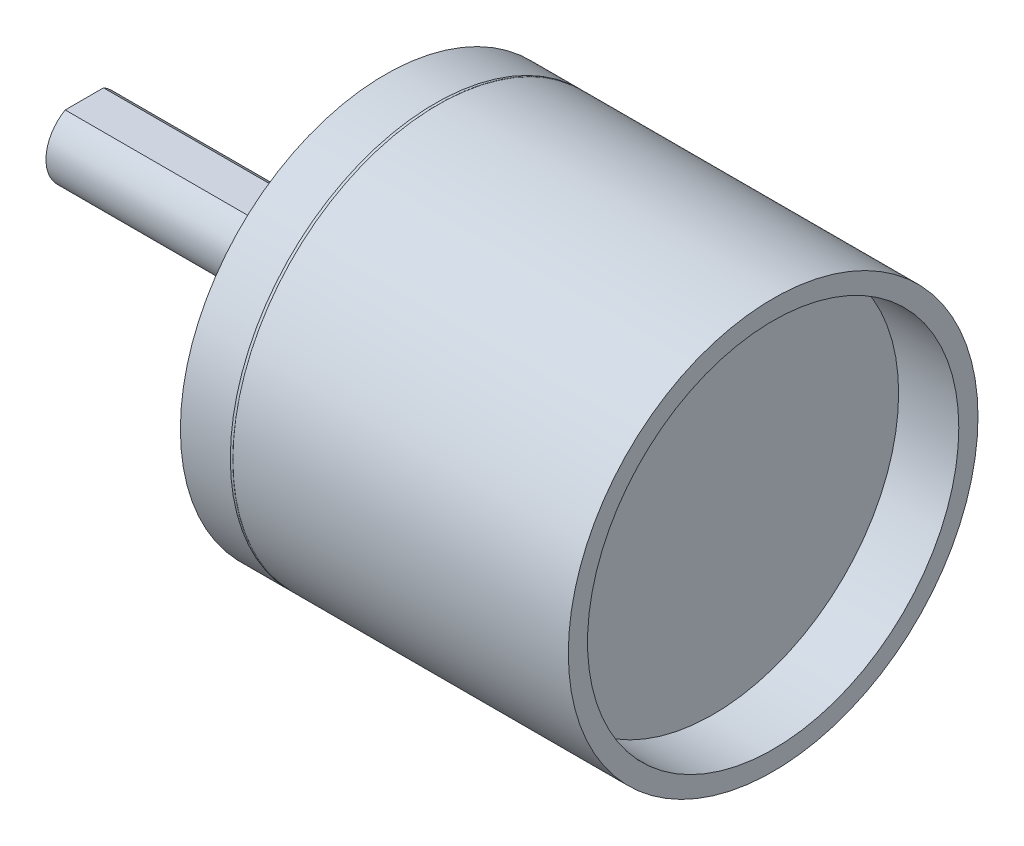
ISO-10303-21;
HEADER;
FILE_DESCRIPTION(('STEP AP214'),'2;1');
FILE_NAME('part.step','',(''),(''),'','','');
FILE_SCHEMA(('AUTOMOTIVE_DESIGN { 1 0 10303 214 1 1 1 1 }'));
ENDSEC;
DATA;
#1=APPLICATION_CONTEXT('core data for automotive mechanical design processes');
#2=APPLICATION_PROTOCOL_DEFINITION('international standard','automotive_design',2000,#1);
#3=PRODUCT_CONTEXT('',#1,'mechanical');
#4=PRODUCT('Part','Part','',(#3));
#5=PRODUCT_RELATED_PRODUCT_CATEGORY('part','',(#4));
#6=PRODUCT_DEFINITION_FORMATION('','',#4);
#7=PRODUCT_DEFINITION_CONTEXT('part definition',#1,'design');
#8=PRODUCT_DEFINITION('design','',#6,#7);
#9=PRODUCT_DEFINITION_SHAPE('','',#8);
#10=(LENGTH_UNIT() NAMED_UNIT(*) SI_UNIT(.MILLI.,.METRE.));
#11=(NAMED_UNIT(*) PLANE_ANGLE_UNIT() SI_UNIT($,.RADIAN.));
#12=(NAMED_UNIT(*) SI_UNIT($,.STERADIAN.) SOLID_ANGLE_UNIT());
#13=UNCERTAINTY_MEASURE_WITH_UNIT(LENGTH_MEASURE(1.E-05),#10,'distance_accuracy_value','');
#14=(GEOMETRIC_REPRESENTATION_CONTEXT(3) GLOBAL_UNCERTAINTY_ASSIGNED_CONTEXT((#13)) GLOBAL_UNIT_ASSIGNED_CONTEXT((#10,
#11,#12)) REPRESENTATION_CONTEXT('',''));
#15=CARTESIAN_POINT('',(0.,0.,0.));
#16=DIRECTION('',(0.,0.,1.));
#17=DIRECTION('',(1.,0.,0.));
#18=AXIS2_PLACEMENT_3D('',#15,#16,#17);
#19=CARTESIAN_POINT('',(-2.6,0.,0.));
#20=DIRECTION('',(-1.,0.,0.));
#21=DIRECTION('',(0.,0.,1.));
#22=AXIS2_PLACEMENT_3D('',#19,#20,#21);
#23=PLANE('',#22);
#24=CARTESIAN_POINT('',(-2.6,0.,0.));
#25=DIRECTION('',(-1.,0.,0.));
#26=DIRECTION('',(0.,0.,1.));
#27=AXIS2_PLACEMENT_3D('',#24,#25,#26);
#28=CIRCLE('',#27,2.5);
#29=CARTESIAN_POINT('',(-2.6,0.,2.5));
#30=VERTEX_POINT('',#29);
#31=EDGE_CURVE('E145',#30,#30,#28,.T.);
#32=ORIENTED_EDGE('',*,*,#31,.T.);
#33=EDGE_LOOP('',(#32));
#34=FACE_BOUND('',#33,.T.);
#35=CARTESIAN_POINT('',(-2.6,0.,0.));
#36=DIRECTION('',(-1.,0.,0.));
#37=DIRECTION('',(0.,0.,1.));
#38=AXIS2_PLACEMENT_3D('',#35,#36,#37);
#39=CIRCLE('',#38,1.5);
#40=CARTESIAN_POINT('',(-2.6,0.,1.5));
#41=VERTEX_POINT('',#40);
#42=EDGE_CURVE('E137',#41,#41,#39,.T.);
#43=ORIENTED_EDGE('',*,*,#42,.F.);
#44=EDGE_LOOP('',(#43));
#45=FACE_BOUND('',#44,.T.);
#46=ADVANCED_FACE('F34',(#34,#45),#23,.T.);
#47=CARTESIAN_POINT('',(-1.,0.,0.));
#48=DIRECTION('',(-1.,0.,0.));
#49=DIRECTION('',(0.,0.,1.));
#50=AXIS2_PLACEMENT_3D('',#47,#48,#49);
#51=PLANE('',#50);
#52=CARTESIAN_POINT('',(-1.,0.,0.));
#53=DIRECTION('',(-1.,0.,0.));
#54=DIRECTION('',(0.,0.,1.));
#55=AXIS2_PLACEMENT_3D('',#52,#53,#54);
#56=CIRCLE('',#55,3.);
#57=CARTESIAN_POINT('',(-1.,0.,3.));
#58=VERTEX_POINT('',#57);
#59=EDGE_CURVE('E151',#58,#58,#56,.T.);
#60=ORIENTED_EDGE('',*,*,#59,.T.);
#61=EDGE_LOOP('',(#60));
#62=FACE_BOUND('',#61,.T.);
#63=CARTESIAN_POINT('',(-1.,0.,0.));
#64=DIRECTION('',(-1.,0.,0.));
#65=DIRECTION('',(0.,0.,1.));
#66=AXIS2_PLACEMENT_3D('',#63,#64,#65);
#67=CIRCLE('',#66,2.5);
#68=CARTESIAN_POINT('',(-1.,0.,2.5));
#69=VERTEX_POINT('',#68);
#70=EDGE_CURVE('E142',#69,#69,#67,.T.);
#71=ORIENTED_EDGE('',*,*,#70,.F.);
#72=EDGE_LOOP('',(#71));
#73=FACE_BOUND('',#72,.T.);
#74=ADVANCED_FACE('F182',(#62,#73),#51,.T.);
#75=CARTESIAN_POINT('',(0.,7.99999999999967,0.));
#76=DIRECTION('',(-1.,0.,0.));
#77=DIRECTION('',(0.,0.,1.));
#78=AXIS2_PLACEMENT_3D('',#75,#76,#77);
#79=PLANE('',#78);
#80=CARTESIAN_POINT('',(0.,4.999999999992,8.726646259967E-06));
#81=DIRECTION('',(-1.,0.,0.));
#82=DIRECTION('',(0.,0.,1.));
#83=AXIS2_PLACEMENT_3D('',#80,#81,#82);
#84=CIRCLE('',#83,0.79999999999999);
#85=CARTESIAN_POINT('',(0.,4.999999999992,0.80000872664625));
#86=VERTEX_POINT('',#85);
#87=EDGE_CURVE('E93',#86,#86,#84,.T.);
#88=ORIENTED_EDGE('',*,*,#87,.F.);
#89=EDGE_LOOP('',(#88));
#90=FACE_BOUND('',#89,.T.);
#91=CARTESIAN_POINT('',(0.,2.499992442499,4.330131382239));
#92=DIRECTION('',(-1.,0.,0.));
#93=DIRECTION('',(0.,0.,1.));
#94=AXIS2_PLACEMENT_3D('',#91,#92,#93);
#95=CIRCLE('',#94,0.79999999999999);
#96=CARTESIAN_POINT('',(0.,2.499992442499,5.13013138223899));
#97=VERTEX_POINT('',#96);
#98=EDGE_CURVE('E92',#97,#97,#95,.T.);
#99=ORIENTED_EDGE('',*,*,#98,.F.);
#100=EDGE_LOOP('',(#99));
#101=FACE_BOUND('',#100,.T.);
#102=CARTESIAN_POINT('',(0.,-2.500007557494,4.330122655592));
#103=DIRECTION('',(-1.,0.,0.));
#104=DIRECTION('',(0.,0.,1.));
#105=AXIS2_PLACEMENT_3D('',#102,#103,#104);
#106=CIRCLE('',#105,0.79999999999999);
#107=CARTESIAN_POINT('',(0.,-2.500007557494,5.13012265559199));
#108=VERTEX_POINT('',#107);
#109=EDGE_CURVE('E103',#108,#108,#106,.T.);
#110=ORIENTED_EDGE('',*,*,#109,.F.);
#111=EDGE_LOOP('',(#110));
#112=FACE_BOUND('',#111,.T.);
#113=CARTESIAN_POINT('',(0.,-4.999999999992,-8.726646259355E-06));
#114=DIRECTION('',(-1.,0.,0.));
#115=DIRECTION('',(0.,0.,1.));
#116=AXIS2_PLACEMENT_3D('',#113,#114,#115);
#117=CIRCLE('',#116,0.79999999999999);
#118=CARTESIAN_POINT('',(0.,-4.999999999992,0.799991273353731));
#119=VERTEX_POINT('',#118);
#120=EDGE_CURVE('E109',#119,#119,#117,.T.);
#121=ORIENTED_EDGE('',*,*,#120,.F.);
#122=EDGE_LOOP('',(#121));
#123=FACE_BOUND('',#122,.T.);
#124=CARTESIAN_POINT('',(0.,-2.499992442499,-4.330131382239));
#125=DIRECTION('',(-1.,0.,0.));
#126=DIRECTION('',(0.,0.,1.));
#127=AXIS2_PLACEMENT_3D('',#124,#125,#126);
#128=CIRCLE('',#127,0.79999999999999);
#129=CARTESIAN_POINT('',(0.,-2.499992442499,-3.53013138223901));
#130=VERTEX_POINT('',#129);
#131=EDGE_CURVE('E115',#130,#130,#128,.T.);
#132=ORIENTED_EDGE('',*,*,#131,.F.);
#133=EDGE_LOOP('',(#132));
#134=FACE_BOUND('',#133,.T.);
#135=CARTESIAN_POINT('',(0.,2.500007557494,-4.330122655592));
#136=DIRECTION('',(-1.,0.,0.));
#137=DIRECTION('',(0.,0.,1.));
#138=AXIS2_PLACEMENT_3D('',#135,#136,#137);
#139=CIRCLE('',#138,0.79999999999999);
#140=CARTESIAN_POINT('',(0.,2.500007557494,-3.53012265559201));
#141=VERTEX_POINT('',#140);
#142=EDGE_CURVE('E121',#141,#141,#139,.T.);
#143=ORIENTED_EDGE('',*,*,#142,.F.);
#144=EDGE_LOOP('',(#143));
#145=FACE_BOUND('',#144,.T.);
#146=CARTESIAN_POINT('',(0.,-3.33305713513381E-13,0.));
#147=DIRECTION('',(1.,0.,0.));
#148=DIRECTION('',(0.,0.,-1.));
#149=AXIS2_PLACEMENT_3D('',#146,#147,#148);
#150=CIRCLE('',#149,8.);
#151=CARTESIAN_POINT('',(0.,-3.33305713513381E-13,-8.));
#152=VERTEX_POINT('',#151);
#153=EDGE_CURVE('E154',#152,#152,#150,.T.);
#154=ORIENTED_EDGE('',*,*,#153,.F.);
#155=EDGE_LOOP('',(#154));
#156=FACE_BOUND('',#155,.T.);
#157=CARTESIAN_POINT('',(0.,0.,0.));
#158=DIRECTION('',(-1.,0.,0.));
#159=DIRECTION('',(0.,0.,1.));
#160=AXIS2_PLACEMENT_3D('',#157,#158,#159);
#161=CIRCLE('',#160,3.);
#162=CARTESIAN_POINT('',(0.,0.,3.));
#163=VERTEX_POINT('',#162);
#164=EDGE_CURVE('E148',#163,#163,#161,.T.);
#165=ORIENTED_EDGE('',*,*,#164,.F.);
#166=EDGE_LOOP('',(#165));
#167=FACE_BOUND('',#166,.T.);
#168=ADVANCED_FACE('F179',(#90,#101,#112,#123,#134,#145,#156,#167),#79,.T.);
#169=CARTESIAN_POINT('',(0.,-3.33305713513381E-13,0.));
#170=DIRECTION('',(1.,0.,0.));
#171=DIRECTION('',(0.,0.,-1.));
#172=AXIS2_PLACEMENT_3D('',#169,#170,#171);
#173=CYLINDRICAL_SURFACE('',#172,8.);
#174=ORIENTED_EDGE('',*,*,#153,.T.);
#175=EDGE_LOOP('',(#174));
#176=FACE_BOUND('',#175,.T.);
#177=CARTESIAN_POINT('',(1.94999999999981,-3.33305713513381E-13,0.));
#178=DIRECTION('',(1.,0.,0.));
#179=DIRECTION('',(0.,0.,-1.));
#180=AXIS2_PLACEMENT_3D('',#177,#178,#179);
#181=CIRCLE('',#180,8.);
#182=CARTESIAN_POINT('',(1.94999999999981,-3.33305713513381E-13,-8.));
#183=VERTEX_POINT('',#182);
#184=EDGE_CURVE('E11',#183,#183,#181,.T.);
#185=ORIENTED_EDGE('',*,*,#184,.F.);
#186=EDGE_LOOP('',(#185));
#187=FACE_BOUND('',#186,.T.);
#188=ADVANCED_FACE('F170',(#176,#187),#173,.T.);
#189=CARTESIAN_POINT('',(1.9999999999999,-3.33066907387547E-13,0.));
#190=DIRECTION('',(1.,0.,0.));
#191=DIRECTION('',(0.,0.,-1.));
#192=AXIS2_PLACEMENT_3D('',#189,#190,#191);
#193=TOROIDAL_SURFACE('',#192,8.08660254037817,0.0999999999998071);
#194=ORIENTED_EDGE('',*,*,#184,.T.);
#195=EDGE_LOOP('',(#194));
#196=FACE_BOUND('',#195,.T.);
#197=CARTESIAN_POINT('',(2.05,-3.33305713513381E-13,0.));
#198=DIRECTION('',(1.,0.,0.));
#199=DIRECTION('',(0.,0.,-1.));
#200=AXIS2_PLACEMENT_3D('',#197,#198,#199);
#201=CIRCLE('',#200,8.);
#202=CARTESIAN_POINT('',(2.05,-3.33305713513381E-13,-8.));
#203=VERTEX_POINT('',#202);
#204=EDGE_CURVE('E43',#203,#203,#201,.T.);
#205=ORIENTED_EDGE('',*,*,#204,.F.);
#206=EDGE_LOOP('',(#205));
#207=FACE_BOUND('',#206,.T.);
#208=ADVANCED_FACE('F168',(#196,#207),#193,.F.);
#209=CARTESIAN_POINT('',(0.,-3.33305713513381E-13,0.));
#210=DIRECTION('',(1.,0.,0.));
#211=DIRECTION('',(0.,0.,-1.));
#212=AXIS2_PLACEMENT_3D('',#209,#210,#211);
#213=CYLINDRICAL_SURFACE('',#212,8.);
#214=ORIENTED_EDGE('',*,*,#204,.T.);
#215=EDGE_LOOP('',(#214));
#216=FACE_BOUND('',#215,.T.);
#217=CARTESIAN_POINT('',(15.15,-3.33305713513381E-13,0.));
#218=DIRECTION('',(1.,0.,0.));
#219=DIRECTION('',(0.,0.,-1.));
#220=AXIS2_PLACEMENT_3D('',#217,#218,#219);
#221=CIRCLE('',#220,8.);
#222=CARTESIAN_POINT('',(15.15,-3.33305713513381E-13,-8.));
#223=VERTEX_POINT('',#222);
#224=EDGE_CURVE('E159',#223,#223,#221,.T.);
#225=ORIENTED_EDGE('',*,*,#224,.F.);
#226=EDGE_LOOP('',(#225));
#227=FACE_BOUND('',#226,.T.);
#228=ADVANCED_FACE('F165',(#216,#227),#213,.T.);
#229=CARTESIAN_POINT('',(15.15,-3.33305713513381E-13,0.));
#230=DIRECTION('',(1.,0.,0.));
#231=DIRECTION('',(0.,0.,-1.));
#232=AXIS2_PLACEMENT_3D('',#229,#230,#231);
#233=PLANE('',#232);
#234=CARTESIAN_POINT('',(15.15,0.,0.));
#235=DIRECTION('',(1.,0.,0.));
#236=DIRECTION('',(0.,0.,-1.));
#237=AXIS2_PLACEMENT_3D('',#234,#235,#236);
#238=CIRCLE('',#237,7.24999999999999);
#239=CARTESIAN_POINT('',(15.15,0.,-7.24999999999999));
#240=VERTEX_POINT('',#239);
#241=EDGE_CURVE('E127',#240,#240,#238,.T.);
#242=ORIENTED_EDGE('',*,*,#241,.F.);
#243=EDGE_LOOP('',(#242));
#244=FACE_BOUND('',#243,.T.);
#245=ORIENTED_EDGE('',*,*,#224,.T.);
#246=EDGE_LOOP('',(#245));
#247=FACE_BOUND('',#246,.T.);
#248=ADVANCED_FACE('F177',(#244,#247),#233,.T.);
#249=CARTESIAN_POINT('',(-1.,0.,0.));
#250=DIRECTION('',(1.,0.,0.));
#251=DIRECTION('',(0.,0.,-1.));
#252=AXIS2_PLACEMENT_3D('',#249,#250,#251);
#253=CYLINDRICAL_SURFACE('',#252,3.);
#254=ORIENTED_EDGE('',*,*,#59,.F.);
#255=EDGE_LOOP('',(#254));
#256=FACE_BOUND('',#255,.T.);
#257=ORIENTED_EDGE('',*,*,#164,.T.);
#258=EDGE_LOOP('',(#257));
#259=FACE_BOUND('',#258,.T.);
#260=ADVANCED_FACE('F197',(#256,#259),#253,.T.);
#261=CARTESIAN_POINT('',(-2.6,0.,0.));
#262=DIRECTION('',(1.,0.,0.));
#263=DIRECTION('',(0.,0.,-1.));
#264=AXIS2_PLACEMENT_3D('',#261,#262,#263);
#265=CYLINDRICAL_SURFACE('',#264,2.5);
#266=ORIENTED_EDGE('',*,*,#31,.F.);
#267=EDGE_LOOP('',(#266));
#268=FACE_BOUND('',#267,.T.);
#269=ORIENTED_EDGE('',*,*,#70,.T.);
#270=EDGE_LOOP('',(#269));
#271=FACE_BOUND('',#270,.T.);
#272=ADVANCED_FACE('F195',(#268,#271),#265,.T.);
#273=CARTESIAN_POINT('',(-11.75,0.,0.));
#274=DIRECTION('',(1.,0.,0.));
#275=DIRECTION('',(0.,0.,-1.));
#276=AXIS2_PLACEMENT_3D('',#273,#274,#275);
#277=CYLINDRICAL_SURFACE('',#276,1.5);
#278=CARTESIAN_POINT('',(-11.75,0.,0.));
#279=DIRECTION('',(-1.,0.,0.));
#280=DIRECTION('',(0.,0.,1.));
#281=AXIS2_PLACEMENT_3D('',#278,#279,#280);
#282=CIRCLE('',#281,1.5);
#283=CARTESIAN_POINT('',(-11.75,1.3,-0.748331477354792));
#284=VERTEX_POINT('',#283);
#285=CARTESIAN_POINT('',(-11.75,1.3,0.748331477354792));
#286=VERTEX_POINT('',#285);
#287=EDGE_CURVE('E139',#284,#286,#282,.T.);
#288=ORIENTED_EDGE('',*,*,#287,.F.);
#289=DIRECTION('',(-1.,0.,0.));
#290=VECTOR('',#289,1.);
#291=CARTESIAN_POINT('',(-3.95,1.3,-0.748331477354792));
#292=LINE('',#291,#290);
#293=CARTESIAN_POINT('',(-3.95,1.3,-0.748331477354792));
#294=VERTEX_POINT('',#293);
#295=EDGE_CURVE('E50',#294,#284,#292,.T.);
#296=ORIENTED_EDGE('',*,*,#295,.F.);
#297=CARTESIAN_POINT('',(-5.22750644205028,0.,0.));
#298=DIRECTION('',(-0.713250449154214,0.700909264299818,0.));
#299=DIRECTION('',(0.700909264299818,0.713250449154214,0.));
#300=AXIS2_PLACEMENT_3D('',#297,#298,#299);
#301=ELLIPSE('',#300,2.10304809731102,1.5);
#302=CARTESIAN_POINT('',(-3.95,1.3,0.748331477354792));
#303=VERTEX_POINT('',#302);
#304=EDGE_CURVE('E38',#303,#294,#301,.T.);
#305=ORIENTED_EDGE('',*,*,#304,.F.);
#306=DIRECTION('',(-1.,0.,0.));
#307=VECTOR('',#306,1.);
#308=CARTESIAN_POINT('',(-3.95,1.3,0.748331477354792));
#309=LINE('',#308,#307);
#310=EDGE_CURVE('E56',#303,#286,#309,.T.);
#311=ORIENTED_EDGE('',*,*,#310,.T.);
#312=EDGE_LOOP('',(#288,#296,#305,#311));
#313=FACE_BOUND('',#312,.T.);
#314=ORIENTED_EDGE('',*,*,#42,.T.);
#315=EDGE_LOOP('',(#314));
#316=FACE_BOUND('',#315,.T.);
#317=ADVANCED_FACE('F193',(#313,#316),#277,.T.);
#318=CARTESIAN_POINT('',(-11.75,0.,0.));
#319=DIRECTION('',(-1.,0.,0.));
#320=DIRECTION('',(0.,0.,1.));
#321=AXIS2_PLACEMENT_3D('',#318,#319,#320);
#322=PLANE('',#321);
#323=DIRECTION('',(0.,0.,1.));
#324=VECTOR('',#323,1.);
#325=CARTESIAN_POINT('',(-11.75,1.3,-0.748331477354792));
#326=LINE('',#325,#324);
#327=EDGE_CURVE('E63',#284,#286,#326,.T.);
#328=ORIENTED_EDGE('',*,*,#327,.F.);
#329=ORIENTED_EDGE('',*,*,#287,.T.);
#330=EDGE_LOOP('',(#328,#329));
#331=FACE_BOUND('',#330,.T.);
#332=ADVANCED_FACE('F233',(#331),#322,.T.);
#333=CARTESIAN_POINT('',(-3.95,1.3,-0.748331477354792));
#334=DIRECTION('',(0.,-1.,0.));
#335=DIRECTION('',(0.,0.,-1.));
#336=AXIS2_PLACEMENT_3D('',#333,#334,#335);
#337=PLANE('',#336);
#338=ORIENTED_EDGE('',*,*,#327,.T.);
#339=ORIENTED_EDGE('',*,*,#310,.F.);
#340=DIRECTION('',(0.,0.,1.));
#341=VECTOR('',#340,1.);
#342=CARTESIAN_POINT('',(-3.95,1.3,-0.748331477354792));
#343=LINE('',#342,#341);
#344=EDGE_CURVE('E133',#294,#303,#343,.T.);
#345=ORIENTED_EDGE('',*,*,#344,.F.);
#346=ORIENTED_EDGE('',*,*,#295,.T.);
#347=EDGE_LOOP('',(#338,#339,#345,#346));
#348=FACE_BOUND('',#347,.T.);
#349=ADVANCED_FACE('F231',(#348),#337,.F.);
#350=CARTESIAN_POINT('',(-3.95,1.3,-0.748331477354792));
#351=DIRECTION('',(-0.713250449154214,0.700909264299818,0.));
#352=DIRECTION('',(-0.700909264299818,-0.713250449154214,0.));
#353=AXIS2_PLACEMENT_3D('',#350,#351,#352);
#354=PLANE('',#353);
#355=ORIENTED_EDGE('',*,*,#304,.T.);
#356=ORIENTED_EDGE('',*,*,#344,.T.);
#357=EDGE_LOOP('',(#355,#356));
#358=FACE_BOUND('',#357,.T.);
#359=ADVANCED_FACE('F36',(#358),#354,.T.);
#360=CARTESIAN_POINT('',(12.8,0.,0.));
#361=DIRECTION('',(-1.,0.,0.));
#362=DIRECTION('',(0.,0.,1.));
#363=AXIS2_PLACEMENT_3D('',#360,#361,#362);
#364=PLANE('',#363);
#365=CARTESIAN_POINT('',(12.8,0.,0.));
#366=DIRECTION('',(1.,0.,0.));
#367=DIRECTION('',(0.,0.,-1.));
#368=AXIS2_PLACEMENT_3D('',#365,#366,#367);
#369=CIRCLE('',#368,7.24999999999999);
#370=CARTESIAN_POINT('',(12.8,0.,-7.24999999999999));
#371=VERTEX_POINT('',#370);
#372=EDGE_CURVE('E130',#371,#371,#369,.T.);
#373=ORIENTED_EDGE('',*,*,#372,.T.);
#374=EDGE_LOOP('',(#373));
#375=FACE_BOUND('',#374,.T.);
#376=ADVANCED_FACE('F217',(#375),#364,.F.);
#377=CARTESIAN_POINT('',(15.15,0.,0.));
#378=DIRECTION('',(1.,0.,0.));
#379=DIRECTION('',(0.,0.,-1.));
#380=AXIS2_PLACEMENT_3D('',#377,#378,#379);
#381=CYLINDRICAL_SURFACE('',#380,7.24999999999999);
#382=ORIENTED_EDGE('',*,*,#372,.F.);
#383=EDGE_LOOP('',(#382));
#384=FACE_BOUND('',#383,.T.);
#385=ORIENTED_EDGE('',*,*,#241,.T.);
#386=EDGE_LOOP('',(#385));
#387=FACE_BOUND('',#386,.T.);
#388=ADVANCED_FACE('F214',(#384,#387),#381,.F.);
#389=CARTESIAN_POINT('',(3.,2.500007557494,-4.330122655592));
#390=DIRECTION('',(-1.,0.,0.));
#391=DIRECTION('',(0.,0.,1.));
#392=AXIS2_PLACEMENT_3D('',#389,#390,#391);
#393=CONICAL_SURFACE('',#392,0.799999999999988,1.02974425847332);
#394=CARTESIAN_POINT('',(3.48068849544344,2.500007557494,-4.330122655592));
#395=VERTEX_POINT('',#394);
#396=VERTEX_LOOP('',#395);
#397=FACE_BOUND('',#396,.T.);
#398=CARTESIAN_POINT('',(3.,2.500007557494,-4.330122655592));
#399=DIRECTION('',(-1.,0.,0.));
#400=DIRECTION('',(0.,0.,1.));
#401=AXIS2_PLACEMENT_3D('',#398,#399,#400);
#402=CIRCLE('',#401,0.799999999999988);
#403=CARTESIAN_POINT('',(3.,2.500007557494,-3.53012265559201));
#404=VERTEX_POINT('',#403);
#405=EDGE_CURVE('E124',#404,#404,#402,.T.);
#406=ORIENTED_EDGE('',*,*,#405,.T.);
#407=EDGE_LOOP('',(#406));
#408=FACE_BOUND('',#407,.T.);
#409=ADVANCED_FACE('F216',(#397,#408),#393,.F.);
#410=CARTESIAN_POINT('',(0.,2.500007557494,-4.330122655592));
#411=DIRECTION('',(-1.,0.,0.));
#412=DIRECTION('',(0.,0.,1.));
#413=AXIS2_PLACEMENT_3D('',#410,#411,#412);
#414=CYLINDRICAL_SURFACE('',#413,0.799999999999989);
#415=ORIENTED_EDGE('',*,*,#405,.F.);
#416=EDGE_LOOP('',(#415));
#417=FACE_BOUND('',#416,.T.);
#418=ORIENTED_EDGE('',*,*,#142,.T.);
#419=EDGE_LOOP('',(#418));
#420=FACE_BOUND('',#419,.T.);
#421=ADVANCED_FACE('F224',(#417,#420),#414,.F.);
#422=CARTESIAN_POINT('',(3.,-2.499992442499,-4.330131382239));
#423=DIRECTION('',(-1.,0.,0.));
#424=DIRECTION('',(0.,0.,1.));
#425=AXIS2_PLACEMENT_3D('',#422,#423,#424);
#426=CONICAL_SURFACE('',#425,0.799999999999988,1.02974425847332);
#427=CARTESIAN_POINT('',(3.48068849544344,-2.499992442499,-4.330131382239));
#428=VERTEX_POINT('',#427);
#429=VERTEX_LOOP('',#428);
#430=FACE_BOUND('',#429,.T.);
#431=CARTESIAN_POINT('',(3.,-2.499992442499,-4.330131382239));
#432=DIRECTION('',(-1.,0.,0.));
#433=DIRECTION('',(0.,0.,1.));
#434=AXIS2_PLACEMENT_3D('',#431,#432,#433);
#435=CIRCLE('',#434,0.799999999999988);
#436=CARTESIAN_POINT('',(3.,-2.499992442499,-3.53013138223901));
#437=VERTEX_POINT('',#436);
#438=EDGE_CURVE('E118',#437,#437,#435,.T.);
#439=ORIENTED_EDGE('',*,*,#438,.T.);
#440=EDGE_LOOP('',(#439));
#441=FACE_BOUND('',#440,.T.);
#442=ADVANCED_FACE('F282',(#430,#441),#426,.F.);
#443=CARTESIAN_POINT('',(0.,-2.499992442499,-4.330131382239));
#444=DIRECTION('',(-1.,0.,0.));
#445=DIRECTION('',(0.,0.,1.));
#446=AXIS2_PLACEMENT_3D('',#443,#444,#445);
#447=CYLINDRICAL_SURFACE('',#446,0.799999999999989);
#448=ORIENTED_EDGE('',*,*,#438,.F.);
#449=EDGE_LOOP('',(#448));
#450=FACE_BOUND('',#449,.T.);
#451=ORIENTED_EDGE('',*,*,#131,.T.);
#452=EDGE_LOOP('',(#451));
#453=FACE_BOUND('',#452,.T.);
#454=ADVANCED_FACE('F291',(#450,#453),#447,.F.);
#455=CARTESIAN_POINT('',(3.,-4.999999999992,-8.726646259355E-06));
#456=DIRECTION('',(-1.,0.,0.));
#457=DIRECTION('',(0.,0.,1.));
#458=AXIS2_PLACEMENT_3D('',#455,#456,#457);
#459=CONICAL_SURFACE('',#458,0.799999999999988,1.02974425847332);
#460=CARTESIAN_POINT('',(3.48068849544344,-4.999999999992,-8.726646259355E-06));
#461=VERTEX_POINT('',#460);
#462=VERTEX_LOOP('',#461);
#463=FACE_BOUND('',#462,.T.);
#464=CARTESIAN_POINT('',(3.,-4.999999999992,-8.726646259355E-06));
#465=DIRECTION('',(-1.,0.,0.));
#466=DIRECTION('',(0.,0.,1.));
#467=AXIS2_PLACEMENT_3D('',#464,#465,#466);
#468=CIRCLE('',#467,0.799999999999988);
#469=CARTESIAN_POINT('',(3.,-4.999999999992,0.799991273353729));
#470=VERTEX_POINT('',#469);
#471=EDGE_CURVE('E112',#470,#470,#468,.T.);
#472=ORIENTED_EDGE('',*,*,#471,.T.);
#473=EDGE_LOOP('',(#472));
#474=FACE_BOUND('',#473,.T.);
#475=ADVANCED_FACE('F301',(#463,#474),#459,.F.);
#476=CARTESIAN_POINT('',(0.,-4.999999999992,-8.726646259355E-06));
#477=DIRECTION('',(-1.,0.,0.));
#478=DIRECTION('',(0.,0.,1.));
#479=AXIS2_PLACEMENT_3D('',#476,#477,#478);
#480=CYLINDRICAL_SURFACE('',#479,0.799999999999989);
#481=ORIENTED_EDGE('',*,*,#471,.F.);
#482=EDGE_LOOP('',(#481));
#483=FACE_BOUND('',#482,.T.);
#484=ORIENTED_EDGE('',*,*,#120,.T.);
#485=EDGE_LOOP('',(#484));
#486=FACE_BOUND('',#485,.T.);
#487=ADVANCED_FACE('F311',(#483,#486),#480,.F.);
#488=CARTESIAN_POINT('',(3.,-2.500007557494,4.330122655592));
#489=DIRECTION('',(-1.,0.,0.));
#490=DIRECTION('',(0.,0.,1.));
#491=AXIS2_PLACEMENT_3D('',#488,#489,#490);
#492=CONICAL_SURFACE('',#491,0.799999999999988,1.02974425847332);
#493=CARTESIAN_POINT('',(3.48068849544344,-2.500007557494,4.330122655592));
#494=VERTEX_POINT('',#493);
#495=VERTEX_LOOP('',#494);
#496=FACE_BOUND('',#495,.T.);
#497=CARTESIAN_POINT('',(3.,-2.500007557494,4.330122655592));
#498=DIRECTION('',(-1.,0.,0.));
#499=DIRECTION('',(0.,0.,1.));
#500=AXIS2_PLACEMENT_3D('',#497,#498,#499);
#501=CIRCLE('',#500,0.799999999999988);
#502=CARTESIAN_POINT('',(3.,-2.500007557494,5.13012265559199));
#503=VERTEX_POINT('',#502);
#504=EDGE_CURVE('E106',#503,#503,#501,.T.);
#505=ORIENTED_EDGE('',*,*,#504,.T.);
#506=EDGE_LOOP('',(#505));
#507=FACE_BOUND('',#506,.T.);
#508=ADVANCED_FACE('F321',(#496,#507),#492,.F.);
#509=CARTESIAN_POINT('',(0.,-2.500007557494,4.330122655592));
#510=DIRECTION('',(-1.,0.,0.));
#511=DIRECTION('',(0.,0.,1.));
#512=AXIS2_PLACEMENT_3D('',#509,#510,#511);
#513=CYLINDRICAL_SURFACE('',#512,0.799999999999989);
#514=ORIENTED_EDGE('',*,*,#504,.F.);
#515=EDGE_LOOP('',(#514));
#516=FACE_BOUND('',#515,.T.);
#517=ORIENTED_EDGE('',*,*,#109,.T.);
#518=EDGE_LOOP('',(#517));
#519=FACE_BOUND('',#518,.T.);
#520=ADVANCED_FACE('F331',(#516,#519),#513,.F.);
#521=CARTESIAN_POINT('',(3.,2.499992442499,4.330131382239));
#522=DIRECTION('',(-1.,0.,0.));
#523=DIRECTION('',(0.,0.,1.));
#524=AXIS2_PLACEMENT_3D('',#521,#522,#523);
#525=CONICAL_SURFACE('',#524,0.799999999999988,1.02974425847332);
#526=CARTESIAN_POINT('',(3.48068849544344,2.499992442499,4.330131382239));
#527=VERTEX_POINT('',#526);
#528=VERTEX_LOOP('',#527);
#529=FACE_BOUND('',#528,.T.);
#530=CARTESIAN_POINT('',(3.,2.499992442499,4.330131382239));
#531=DIRECTION('',(-1.,0.,0.));
#532=DIRECTION('',(0.,0.,1.));
#533=AXIS2_PLACEMENT_3D('',#530,#531,#532);
#534=CIRCLE('',#533,0.799999999999988);
#535=CARTESIAN_POINT('',(3.,2.499992442499,5.13013138223899));
#536=VERTEX_POINT('',#535);
#537=EDGE_CURVE('E96',#536,#536,#534,.T.);
#538=ORIENTED_EDGE('',*,*,#537,.T.);
#539=EDGE_LOOP('',(#538));
#540=FACE_BOUND('',#539,.T.);
#541=ADVANCED_FACE('F341',(#529,#540),#525,.F.);
#542=CARTESIAN_POINT('',(0.,2.499992442499,4.330131382239));
#543=DIRECTION('',(-1.,0.,0.));
#544=DIRECTION('',(0.,0.,1.));
#545=AXIS2_PLACEMENT_3D('',#542,#543,#544);
#546=CYLINDRICAL_SURFACE('',#545,0.799999999999989);
#547=ORIENTED_EDGE('',*,*,#537,.F.);
#548=EDGE_LOOP('',(#547));
#549=FACE_BOUND('',#548,.T.);
#550=ORIENTED_EDGE('',*,*,#98,.T.);
#551=EDGE_LOOP('',(#550));
#552=FACE_BOUND('',#551,.T.);
#553=ADVANCED_FACE('F86',(#549,#552),#546,.F.);
#554=CARTESIAN_POINT('',(3.,4.999999999992,8.726646259967E-06));
#555=DIRECTION('',(-1.,0.,0.));
#556=DIRECTION('',(0.,0.,1.));
#557=AXIS2_PLACEMENT_3D('',#554,#555,#556);
#558=CONICAL_SURFACE('',#557,0.799999999999988,1.02974425847332);
#559=CARTESIAN_POINT('',(3.48068849544344,4.999999999992,8.726646259967E-06));
#560=VERTEX_POINT('',#559);
#561=VERTEX_LOOP('',#560);
#562=FACE_BOUND('',#561,.T.);
#563=CARTESIAN_POINT('',(3.,4.999999999992,8.726646259967E-06));
#564=DIRECTION('',(-1.,0.,0.));
#565=DIRECTION('',(0.,0.,1.));
#566=AXIS2_PLACEMENT_3D('',#563,#564,#565);
#567=CIRCLE('',#566,0.799999999999988);
#568=CARTESIAN_POINT('',(3.,4.999999999992,0.800008726646248));
#569=VERTEX_POINT('',#568);
#570=EDGE_CURVE('E90',#569,#569,#567,.T.);
#571=ORIENTED_EDGE('',*,*,#570,.T.);
#572=EDGE_LOOP('',(#571));
#573=FACE_BOUND('',#572,.T.);
#574=ADVANCED_FACE('F82',(#562,#573),#558,.F.);
#575=CARTESIAN_POINT('',(0.,4.999999999992,8.726646259967E-06));
#576=DIRECTION('',(-1.,0.,0.));
#577=DIRECTION('',(0.,0.,1.));
#578=AXIS2_PLACEMENT_3D('',#575,#576,#577);
#579=CYLINDRICAL_SURFACE('',#578,0.799999999999989);
#580=ORIENTED_EDGE('',*,*,#570,.F.);
#581=EDGE_LOOP('',(#580));
#582=FACE_BOUND('',#581,.T.);
#583=ORIENTED_EDGE('',*,*,#87,.T.);
#584=EDGE_LOOP('',(#583));
#585=FACE_BOUND('',#584,.T.);
#586=ADVANCED_FACE('F85',(#582,#585),#579,.F.);
#587=CLOSED_SHELL('',(#46,#74,#168,#188,#208,#228,#248,#260,#272,#317,#332,#349,#359,#376,#388,
#409,#421,#442,#454,#475,#487,#508,#520,#541,#553,#574,#586));
#588=MANIFOLD_SOLID_BREP('B2',#587);
#589=ADVANCED_BREP_SHAPE_REPRESENTATION('',(#18,#588),#14);
#590=SHAPE_DEFINITION_REPRESENTATION(#9,#589);
ENDSEC;
END-ISO-10303-21;
